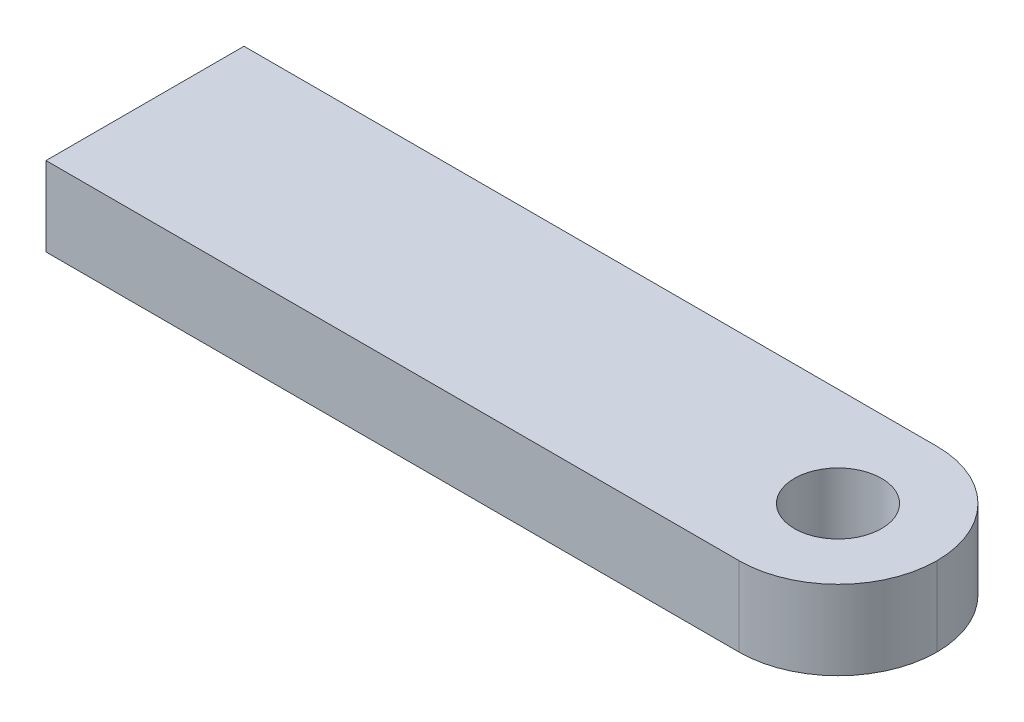
ISO-10303-21;
HEADER;
FILE_DESCRIPTION(('STEP AP214'),'2;1');
FILE_NAME('part.step','',(''),(''),'','','');
FILE_SCHEMA(('AUTOMOTIVE_DESIGN { 1 0 10303 214 1 1 1 1 }'));
ENDSEC;
DATA;
#1=APPLICATION_CONTEXT('core data for automotive mechanical design processes');
#2=APPLICATION_PROTOCOL_DEFINITION('international standard','automotive_design',2000,#1);
#3=PRODUCT_CONTEXT('',#1,'mechanical');
#4=PRODUCT('Part','Part','',(#3));
#5=PRODUCT_RELATED_PRODUCT_CATEGORY('part','',(#4));
#6=PRODUCT_DEFINITION_FORMATION('','',#4);
#7=PRODUCT_DEFINITION_CONTEXT('part definition',#1,'design');
#8=PRODUCT_DEFINITION('design','',#6,#7);
#9=PRODUCT_DEFINITION_SHAPE('','',#8);
#10=(LENGTH_UNIT() NAMED_UNIT(*) SI_UNIT(.MILLI.,.METRE.));
#11=(NAMED_UNIT(*) PLANE_ANGLE_UNIT() SI_UNIT($,.RADIAN.));
#12=(NAMED_UNIT(*) SI_UNIT($,.STERADIAN.) SOLID_ANGLE_UNIT());
#13=UNCERTAINTY_MEASURE_WITH_UNIT(LENGTH_MEASURE(1.E-05),#10,'distance_accuracy_value','');
#14=(GEOMETRIC_REPRESENTATION_CONTEXT(3) GLOBAL_UNCERTAINTY_ASSIGNED_CONTEXT((#13)) GLOBAL_UNIT_ASSIGNED_CONTEXT((#10,
#11,#12)) REPRESENTATION_CONTEXT('',''));
#15=CARTESIAN_POINT('',(0.,0.,0.));
#16=DIRECTION('',(0.,0.,1.));
#17=DIRECTION('',(1.,0.,0.));
#18=AXIS2_PLACEMENT_3D('',#15,#16,#17);
#19=CARTESIAN_POINT('',(-10.,2.,-2.5));
#20=DIRECTION('',(1.,0.,0.));
#21=DIRECTION('',(0.,0.,-1.));
#22=AXIS2_PLACEMENT_3D('',#19,#20,#21);
#23=PLANE('',#22);
#24=DIRECTION('',(0.,0.,1.));
#25=VECTOR('',#24,1.);
#26=CARTESIAN_POINT('',(-10.,0.,-2.5));
#27=LINE('',#26,#25);
#28=CARTESIAN_POINT('',(-10.,0.,-2.5));
#29=VERTEX_POINT('',#28);
#30=CARTESIAN_POINT('',(-10.,0.,2.5));
#31=VERTEX_POINT('',#30);
#32=EDGE_CURVE('E100',#29,#31,#27,.T.);
#33=ORIENTED_EDGE('',*,*,#32,.T.);
#34=DIRECTION('',(0.,-1.,0.));
#35=VECTOR('',#34,1.);
#36=CARTESIAN_POINT('',(-10.,2.,2.5));
#37=LINE('',#36,#35);
#38=CARTESIAN_POINT('',(-10.,2.,2.5));
#39=VERTEX_POINT('',#38);
#40=EDGE_CURVE('E86',#39,#31,#37,.T.);
#41=ORIENTED_EDGE('',*,*,#40,.F.);
#42=DIRECTION('',(0.,0.,1.));
#43=VECTOR('',#42,1.);
#44=CARTESIAN_POINT('',(-10.,2.,-2.5));
#45=LINE('',#44,#43);
#46=CARTESIAN_POINT('',(-10.,2.,-2.5));
#47=VERTEX_POINT('',#46);
#48=EDGE_CURVE('E89',#47,#39,#45,.T.);
#49=ORIENTED_EDGE('',*,*,#48,.F.);
#50=DIRECTION('',(0.,-1.,0.));
#51=VECTOR('',#50,1.);
#52=CARTESIAN_POINT('',(-10.,2.,-2.5));
#53=LINE('',#52,#51);
#54=EDGE_CURVE('E102',#47,#29,#53,.T.);
#55=ORIENTED_EDGE('',*,*,#54,.T.);
#56=EDGE_LOOP('',(#33,#41,#49,#55));
#57=FACE_BOUND('',#56,.T.);
#58=ADVANCED_FACE('F37',(#57),#23,.F.);
#59=CARTESIAN_POINT('',(-10.,2.,2.5));
#60=DIRECTION('',(0.,0.,-1.));
#61=DIRECTION('',(-1.,0.,0.));
#62=AXIS2_PLACEMENT_3D('',#59,#60,#61);
#63=PLANE('',#62);
#64=DIRECTION('',(1.,0.,0.));
#65=VECTOR('',#64,1.);
#66=CARTESIAN_POINT('',(-10.,0.,2.5));
#67=LINE('',#66,#65);
#68=CARTESIAN_POINT('',(7.5,0.,2.5));
#69=VERTEX_POINT('',#68);
#70=EDGE_CURVE('E137',#31,#69,#67,.T.);
#71=ORIENTED_EDGE('',*,*,#70,.T.);
#72=DIRECTION('',(0.,-1.,0.));
#73=VECTOR('',#72,1.);
#74=CARTESIAN_POINT('',(7.5,2.,2.5));
#75=LINE('',#74,#73);
#76=CARTESIAN_POINT('',(7.5,2.,2.5));
#77=VERTEX_POINT('',#76);
#78=EDGE_CURVE('E11',#69,#77,#75,.F.);
#79=ORIENTED_EDGE('',*,*,#78,.T.);
#80=DIRECTION('',(1.,0.,0.));
#81=VECTOR('',#80,1.);
#82=CARTESIAN_POINT('',(-10.,2.,2.5));
#83=LINE('',#82,#81);
#84=EDGE_CURVE('E82',#39,#77,#83,.T.);
#85=ORIENTED_EDGE('',*,*,#84,.F.);
#86=ORIENTED_EDGE('',*,*,#40,.T.);
#87=EDGE_LOOP('',(#71,#79,#85,#86));
#88=FACE_BOUND('',#87,.T.);
#89=ADVANCED_FACE('F84',(#88),#63,.F.);
#90=CARTESIAN_POINT('',(-10.,2.,-2.5));
#91=DIRECTION('',(0.,0.,1.));
#92=DIRECTION('',(1.,0.,0.));
#93=AXIS2_PLACEMENT_3D('',#90,#91,#92);
#94=PLANE('',#93);
#95=DIRECTION('',(-1.,0.,0.));
#96=VECTOR('',#95,1.);
#97=CARTESIAN_POINT('',(-10.,2.,-2.5));
#98=LINE('',#97,#96);
#99=CARTESIAN_POINT('',(7.5,2.,-2.5));
#100=VERTEX_POINT('',#99);
#101=EDGE_CURVE('E88',#100,#47,#98,.T.);
#102=ORIENTED_EDGE('',*,*,#101,.F.);
#103=DIRECTION('',(0.,-1.,0.));
#104=VECTOR('',#103,1.);
#105=CARTESIAN_POINT('',(7.5,2.,-2.5));
#106=LINE('',#105,#104);
#107=CARTESIAN_POINT('',(7.5,0.,-2.5));
#108=VERTEX_POINT('',#107);
#109=EDGE_CURVE('E101',#100,#108,#106,.T.);
#110=ORIENTED_EDGE('',*,*,#109,.T.);
#111=DIRECTION('',(-1.,0.,0.));
#112=VECTOR('',#111,1.);
#113=CARTESIAN_POINT('',(-10.,0.,-2.5));
#114=LINE('',#113,#112);
#115=EDGE_CURVE('E97',#108,#29,#114,.T.);
#116=ORIENTED_EDGE('',*,*,#115,.T.);
#117=ORIENTED_EDGE('',*,*,#54,.F.);
#118=EDGE_LOOP('',(#102,#110,#116,#117));
#119=FACE_BOUND('',#118,.T.);
#120=ADVANCED_FACE('F119',(#119),#94,.F.);
#121=CARTESIAN_POINT('',(0.,2.,0.));
#122=DIRECTION('',(0.,1.,0.));
#123=DIRECTION('',(0.,0.,1.));
#124=AXIS2_PLACEMENT_3D('',#121,#122,#123);
#125=PLANE('',#124);
#126=CARTESIAN_POINT('',(7.5,2.,0.));
#127=DIRECTION('',(0.,1.,0.));
#128=DIRECTION('',(0.,0.,1.));
#129=AXIS2_PLACEMENT_3D('',#126,#127,#128);
#130=CIRCLE('',#129,1.1);
#131=CARTESIAN_POINT('',(7.5,2.,1.1));
#132=VERTEX_POINT('',#131);
#133=EDGE_CURVE('E127',#132,#132,#130,.T.);
#134=ORIENTED_EDGE('',*,*,#133,.F.);
#135=EDGE_LOOP('',(#134));
#136=FACE_BOUND('',#135,.T.);
#137=CARTESIAN_POINT('',(7.5,2.,0.));
#138=DIRECTION('',(0.,1.,0.));
#139=DIRECTION('',(0.,0.,1.));
#140=AXIS2_PLACEMENT_3D('',#137,#138,#139);
#141=CIRCLE('',#140,2.5);
#142=CARTESIAN_POINT('',(10.,2.,0.));
#143=VERTEX_POINT('',#142);
#144=EDGE_CURVE('E53',#77,#143,#141,.T.);
#145=ORIENTED_EDGE('',*,*,#144,.T.);
#146=CARTESIAN_POINT('',(7.5,2.,0.));
#147=DIRECTION('',(0.,1.,0.));
#148=DIRECTION('',(0.,0.,1.));
#149=AXIS2_PLACEMENT_3D('',#146,#147,#148);
#150=CIRCLE('',#149,2.5);
#151=EDGE_CURVE('E46',#143,#100,#150,.T.);
#152=ORIENTED_EDGE('',*,*,#151,.T.);
#153=ORIENTED_EDGE('',*,*,#101,.T.);
#154=ORIENTED_EDGE('',*,*,#48,.T.);
#155=ORIENTED_EDGE('',*,*,#84,.T.);
#156=EDGE_LOOP('',(#145,#152,#153,#154,#155));
#157=FACE_BOUND('',#156,.T.);
#158=ADVANCED_FACE('F92',(#136,#157),#125,.T.);
#159=CARTESIAN_POINT('',(0.,0.,0.));
#160=DIRECTION('',(0.,1.,0.));
#161=DIRECTION('',(0.,0.,1.));
#162=AXIS2_PLACEMENT_3D('',#159,#160,#161);
#163=PLANE('',#162);
#164=CARTESIAN_POINT('',(7.5,0.,0.));
#165=DIRECTION('',(0.,1.,0.));
#166=DIRECTION('',(0.,0.,1.));
#167=AXIS2_PLACEMENT_3D('',#164,#165,#166);
#168=CIRCLE('',#167,1.1);
#169=CARTESIAN_POINT('',(7.5,0.,1.1));
#170=VERTEX_POINT('',#169);
#171=EDGE_CURVE('E129',#170,#170,#168,.T.);
#172=ORIENTED_EDGE('',*,*,#171,.T.);
#173=EDGE_LOOP('',(#172));
#174=FACE_BOUND('',#173,.T.);
#175=ORIENTED_EDGE('',*,*,#115,.F.);
#176=CARTESIAN_POINT('',(7.5,0.,0.));
#177=DIRECTION('',(0.,1.,0.));
#178=DIRECTION('',(0.,0.,1.));
#179=AXIS2_PLACEMENT_3D('',#176,#177,#178);
#180=CIRCLE('',#179,2.5);
#181=CARTESIAN_POINT('',(10.,0.,0.));
#182=VERTEX_POINT('',#181);
#183=EDGE_CURVE('E111',#108,#182,#180,.F.);
#184=ORIENTED_EDGE('',*,*,#183,.T.);
#185=CARTESIAN_POINT('',(7.5,0.,0.));
#186=DIRECTION('',(0.,1.,0.));
#187=DIRECTION('',(0.,0.,1.));
#188=AXIS2_PLACEMENT_3D('',#185,#186,#187);
#189=CIRCLE('',#188,2.5);
#190=EDGE_CURVE('E105',#182,#69,#189,.F.);
#191=ORIENTED_EDGE('',*,*,#190,.T.);
#192=ORIENTED_EDGE('',*,*,#70,.F.);
#193=ORIENTED_EDGE('',*,*,#32,.F.);
#194=EDGE_LOOP('',(#175,#184,#191,#192,#193));
#195=FACE_BOUND('',#194,.T.);
#196=ADVANCED_FACE('F125',(#174,#195),#163,.F.);
#197=CARTESIAN_POINT('',(7.5,0.,0.));
#198=DIRECTION('',(0.,1.,0.));
#199=DIRECTION('',(0.,0.,1.));
#200=AXIS2_PLACEMENT_3D('',#197,#198,#199);
#201=CYLINDRICAL_SURFACE('',#200,1.1);
#202=ORIENTED_EDGE('',*,*,#171,.F.);
#203=EDGE_LOOP('',(#202));
#204=FACE_BOUND('',#203,.T.);
#205=ORIENTED_EDGE('',*,*,#133,.T.);
#206=EDGE_LOOP('',(#205));
#207=FACE_BOUND('',#206,.T.);
#208=ADVANCED_FACE('F141',(#204,#207),#201,.F.);
#209=CARTESIAN_POINT('',(7.5,2.,0.));
#210=DIRECTION('',(0.,-1.,0.));
#211=DIRECTION('',(0.,0.,-1.));
#212=AXIS2_PLACEMENT_3D('',#209,#210,#211);
#213=CYLINDRICAL_SURFACE('',#212,2.5);
#214=DIRECTION('',(0.,-1.,0.));
#215=VECTOR('',#214,1.);
#216=CARTESIAN_POINT('',(10.,2.,0.));
#217=LINE('',#216,#215);
#218=EDGE_CURVE('E41',#143,#182,#217,.T.);
#219=ORIENTED_EDGE('',*,*,#218,.F.);
#220=ORIENTED_EDGE('',*,*,#144,.F.);
#221=ORIENTED_EDGE('',*,*,#78,.F.);
#222=ORIENTED_EDGE('',*,*,#190,.F.);
#223=EDGE_LOOP('',(#219,#220,#221,#222));
#224=FACE_BOUND('',#223,.T.);
#225=ADVANCED_FACE('F39',(#224),#213,.T.);
#226=CARTESIAN_POINT('',(7.5,2.,0.));
#227=DIRECTION('',(0.,-1.,0.));
#228=DIRECTION('',(0.,0.,-1.));
#229=AXIS2_PLACEMENT_3D('',#226,#227,#228);
#230=CYLINDRICAL_SURFACE('',#229,2.5);
#231=ORIENTED_EDGE('',*,*,#151,.F.);
#232=ORIENTED_EDGE('',*,*,#218,.T.);
#233=ORIENTED_EDGE('',*,*,#183,.F.);
#234=ORIENTED_EDGE('',*,*,#109,.F.);
#235=EDGE_LOOP('',(#231,#232,#233,#234));
#236=FACE_BOUND('',#235,.T.);
#237=ADVANCED_FACE('F122',(#236),#230,.T.);
#238=CLOSED_SHELL('',(#58,#89,#120,#158,#196,#208,#225,#237));
#239=MANIFOLD_SOLID_BREP('B2',#238);
#240=ADVANCED_BREP_SHAPE_REPRESENTATION('',(#18,#239),#14);
#241=SHAPE_DEFINITION_REPRESENTATION(#9,#240);
ENDSEC;
END-ISO-10303-21;
